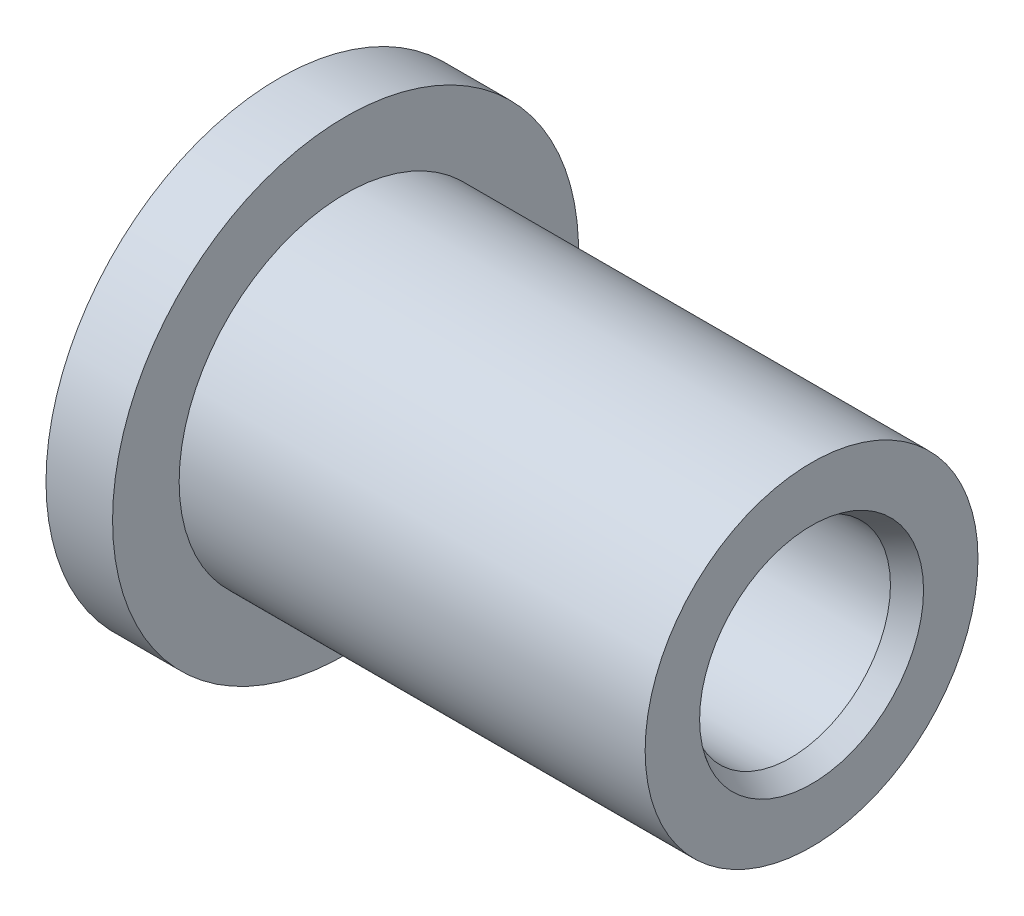
ISO-10303-21;
HEADER;
FILE_DESCRIPTION(('STEP AP214'),'2;1');
FILE_NAME('part.step','',(''),(''),'','','');
FILE_SCHEMA(('AUTOMOTIVE_DESIGN { 1 0 10303 214 1 1 1 1 }'));
ENDSEC;
DATA;
#1=APPLICATION_CONTEXT('core data for automotive mechanical design processes');
#2=APPLICATION_PROTOCOL_DEFINITION('international standard','automotive_design',2000,#1);
#3=PRODUCT_CONTEXT('',#1,'mechanical');
#4=PRODUCT('Part','Part','',(#3));
#5=PRODUCT_RELATED_PRODUCT_CATEGORY('part','',(#4));
#6=PRODUCT_DEFINITION_FORMATION('','',#4);
#7=PRODUCT_DEFINITION_CONTEXT('part definition',#1,'design');
#8=PRODUCT_DEFINITION('design','',#6,#7);
#9=PRODUCT_DEFINITION_SHAPE('','',#8);
#10=(LENGTH_UNIT() NAMED_UNIT(*) SI_UNIT(.MILLI.,.METRE.));
#11=(NAMED_UNIT(*) PLANE_ANGLE_UNIT() SI_UNIT($,.RADIAN.));
#12=(NAMED_UNIT(*) SI_UNIT($,.STERADIAN.) SOLID_ANGLE_UNIT());
#13=UNCERTAINTY_MEASURE_WITH_UNIT(LENGTH_MEASURE(1.E-05),#10,'distance_accuracy_value','');
#14=(GEOMETRIC_REPRESENTATION_CONTEXT(3) GLOBAL_UNCERTAINTY_ASSIGNED_CONTEXT((#13)) GLOBAL_UNIT_ASSIGNED_CONTEXT((#10,
#11,#12)) REPRESENTATION_CONTEXT('',''));
#15=CARTESIAN_POINT('',(0.,0.,0.));
#16=DIRECTION('',(0.,0.,1.));
#17=DIRECTION('',(1.,0.,0.));
#18=AXIS2_PLACEMENT_3D('',#15,#16,#17);
#19=CARTESIAN_POINT('',(0.,0.,0.));
#20=DIRECTION('',(-1.,0.,0.));
#21=DIRECTION('',(0.,0.,1.));
#22=AXIS2_PLACEMENT_3D('',#19,#20,#21);
#23=CYLINDRICAL_SURFACE('',#22,2.38125);
#24=CARTESIAN_POINT('',(12.2,0.,0.));
#25=DIRECTION('',(-1.,0.,0.));
#26=DIRECTION('',(0.,0.,1.));
#27=AXIS2_PLACEMENT_3D('',#24,#25,#26);
#28=CIRCLE('',#27,2.38125);
#29=CARTESIAN_POINT('',(12.2,0.,2.38125));
#30=VERTEX_POINT('',#29);
#31=EDGE_CURVE('E36',#30,#30,#28,.F.);
#32=ORIENTED_EDGE('',*,*,#31,.T.);
#33=EDGE_LOOP('',(#32));
#34=FACE_BOUND('',#33,.T.);
#35=CARTESIAN_POINT('',(0.288675134594815,0.,0.));
#36=DIRECTION('',(1.,0.,0.));
#37=DIRECTION('',(0.,0.,-1.));
#38=AXIS2_PLACEMENT_3D('',#35,#36,#37);
#39=CIRCLE('',#38,2.38125);
#40=CARTESIAN_POINT('',(0.288675134594815,0.,-2.38125));
#41=VERTEX_POINT('',#40);
#42=EDGE_CURVE('E40',#41,#41,#39,.F.);
#43=ORIENTED_EDGE('',*,*,#42,.T.);
#44=EDGE_LOOP('',(#43));
#45=FACE_BOUND('',#44,.T.);
#46=ADVANCED_FACE('F29',(#34,#45),#23,.F.);
#47=CARTESIAN_POINT('',(0.,2.38125,0.));
#48=DIRECTION('',(1.,0.,0.));
#49=DIRECTION('',(0.,0.,-1.));
#50=AXIS2_PLACEMENT_3D('',#47,#48,#49);
#51=PLANE('',#50);
#52=CARTESIAN_POINT('',(0.,0.,0.));
#53=DIRECTION('',(1.,0.,0.));
#54=DIRECTION('',(0.,0.,-1.));
#55=AXIS2_PLACEMENT_3D('',#52,#53,#54);
#56=CIRCLE('',#55,2.88125000000001);
#57=CARTESIAN_POINT('',(0.,0.,-2.88125000000001));
#58=VERTEX_POINT('',#57);
#59=EDGE_CURVE('E10',#58,#58,#56,.T.);
#60=ORIENTED_EDGE('',*,*,#59,.T.);
#61=EDGE_LOOP('',(#60));
#62=FACE_BOUND('',#61,.T.);
#63=CARTESIAN_POINT('',(0.,0.,0.));
#64=DIRECTION('',(-1.,0.,0.));
#65=DIRECTION('',(0.,0.,1.));
#66=AXIS2_PLACEMENT_3D('',#63,#64,#65);
#67=CIRCLE('',#66,5.55625);
#68=CARTESIAN_POINT('',(0.,0.,5.55625));
#69=VERTEX_POINT('',#68);
#70=EDGE_CURVE('E49',#69,#69,#67,.T.);
#71=ORIENTED_EDGE('',*,*,#70,.T.);
#72=EDGE_LOOP('',(#71));
#73=FACE_BOUND('',#72,.T.);
#74=ADVANCED_FACE('F78',(#62,#73),#51,.F.);
#75=CARTESIAN_POINT('',(0.,0.,0.));
#76=DIRECTION('',(-1.,0.,0.));
#77=DIRECTION('',(0.,0.,1.));
#78=AXIS2_PLACEMENT_3D('',#75,#76,#77);
#79=CYLINDRICAL_SURFACE('',#78,5.55625);
#80=ORIENTED_EDGE('',*,*,#70,.F.);
#81=EDGE_LOOP('',(#80));
#82=FACE_BOUND('',#81,.T.);
#83=CARTESIAN_POINT('',(1.5875,0.,0.));
#84=DIRECTION('',(-1.,0.,0.));
#85=DIRECTION('',(0.,0.,1.));
#86=AXIS2_PLACEMENT_3D('',#83,#84,#85);
#87=CIRCLE('',#86,5.55625);
#88=CARTESIAN_POINT('',(1.5875,0.,5.55625));
#89=VERTEX_POINT('',#88);
#90=EDGE_CURVE('E52',#89,#89,#87,.T.);
#91=ORIENTED_EDGE('',*,*,#90,.T.);
#92=EDGE_LOOP('',(#91));
#93=FACE_BOUND('',#92,.T.);
#94=ADVANCED_FACE('F83',(#82,#93),#79,.T.);
#95=CARTESIAN_POINT('',(1.5875,5.55625,0.));
#96=DIRECTION('',(-1.,0.,0.));
#97=DIRECTION('',(0.,0.,1.));
#98=AXIS2_PLACEMENT_3D('',#95,#96,#97);
#99=PLANE('',#98);
#100=ORIENTED_EDGE('',*,*,#90,.F.);
#101=EDGE_LOOP('',(#100));
#102=FACE_BOUND('',#101,.T.);
#103=CARTESIAN_POINT('',(1.5875,0.,0.));
#104=DIRECTION('',(-1.,0.,0.));
#105=DIRECTION('',(0.,0.,1.));
#106=AXIS2_PLACEMENT_3D('',#103,#104,#105);
#107=CIRCLE('',#106,3.96875);
#108=CARTESIAN_POINT('',(1.5875,0.,3.96875));
#109=VERTEX_POINT('',#108);
#110=EDGE_CURVE('E55',#109,#109,#107,.T.);
#111=ORIENTED_EDGE('',*,*,#110,.T.);
#112=EDGE_LOOP('',(#111));
#113=FACE_BOUND('',#112,.T.);
#114=ADVANCED_FACE('F74',(#102,#113),#99,.F.);
#115=CARTESIAN_POINT('',(0.,0.,0.));
#116=DIRECTION('',(-1.,0.,0.));
#117=DIRECTION('',(0.,0.,1.));
#118=AXIS2_PLACEMENT_3D('',#115,#116,#117);
#119=CYLINDRICAL_SURFACE('',#118,3.96875);
#120=ORIENTED_EDGE('',*,*,#110,.F.);
#121=EDGE_LOOP('',(#120));
#122=FACE_BOUND('',#121,.T.);
#123=CARTESIAN_POINT('',(12.7,0.,0.));
#124=DIRECTION('',(-1.,0.,0.));
#125=DIRECTION('',(0.,0.,1.));
#126=AXIS2_PLACEMENT_3D('',#123,#124,#125);
#127=CIRCLE('',#126,3.96875);
#128=CARTESIAN_POINT('',(12.7,0.,3.96875));
#129=VERTEX_POINT('',#128);
#130=EDGE_CURVE('E58',#129,#129,#127,.T.);
#131=ORIENTED_EDGE('',*,*,#130,.T.);
#132=EDGE_LOOP('',(#131));
#133=FACE_BOUND('',#132,.T.);
#134=ADVANCED_FACE('F62',(#122,#133),#119,.T.);
#135=CARTESIAN_POINT('',(12.7,3.96875,0.));
#136=DIRECTION('',(-1.,0.,0.));
#137=DIRECTION('',(0.,0.,1.));
#138=AXIS2_PLACEMENT_3D('',#135,#136,#137);
#139=PLANE('',#138);
#140=CARTESIAN_POINT('',(12.7,0.,0.));
#141=DIRECTION('',(-1.,0.,0.));
#142=DIRECTION('',(0.,0.,1.));
#143=AXIS2_PLACEMENT_3D('',#140,#141,#142);
#144=CIRCLE('',#143,2.66992513459481);
#145=CARTESIAN_POINT('',(12.7,0.,2.66992513459481));
#146=VERTEX_POINT('',#145);
#147=EDGE_CURVE('E44',#146,#146,#144,.T.);
#148=ORIENTED_EDGE('',*,*,#147,.T.);
#149=EDGE_LOOP('',(#148));
#150=FACE_BOUND('',#149,.T.);
#151=ORIENTED_EDGE('',*,*,#130,.F.);
#152=EDGE_LOOP('',(#151));
#153=FACE_BOUND('',#152,.T.);
#154=ADVANCED_FACE('F64',(#150,#153),#139,.F.);
#155=CARTESIAN_POINT('',(12.7,0.,0.));
#156=DIRECTION('',(1.,0.,0.));
#157=DIRECTION('',(0.,0.,-1.));
#158=AXIS2_PLACEMENT_3D('',#155,#156,#157);
#159=CONICAL_SURFACE('',#158,2.66992513459481,0.523598775598299);
#160=ORIENTED_EDGE('',*,*,#31,.F.);
#161=EDGE_LOOP('',(#160));
#162=FACE_BOUND('',#161,.T.);
#163=ORIENTED_EDGE('',*,*,#147,.F.);
#164=EDGE_LOOP('',(#163));
#165=FACE_BOUND('',#164,.T.);
#166=ADVANCED_FACE('F66',(#162,#165),#159,.F.);
#167=CARTESIAN_POINT('',(0.288675134594815,0.,0.));
#168=DIRECTION('',(-1.,0.,0.));
#169=DIRECTION('',(0.,0.,1.));
#170=AXIS2_PLACEMENT_3D('',#167,#168,#169);
#171=CONICAL_SURFACE('',#170,2.38125,1.0471975511966);
#172=ORIENTED_EDGE('',*,*,#59,.F.);
#173=EDGE_LOOP('',(#172));
#174=FACE_BOUND('',#173,.T.);
#175=ORIENTED_EDGE('',*,*,#42,.F.);
#176=EDGE_LOOP('',(#175));
#177=FACE_BOUND('',#176,.T.);
#178=ADVANCED_FACE('F31',(#174,#177),#171,.F.);
#179=CLOSED_SHELL('',(#46,#74,#94,#114,#134,#154,#166,#178));
#180=MANIFOLD_SOLID_BREP('B2',#179);
#181=ADVANCED_BREP_SHAPE_REPRESENTATION('',(#18,#180),#14);
#182=SHAPE_DEFINITION_REPRESENTATION(#9,#181);
ENDSEC;
END-ISO-10303-21;
